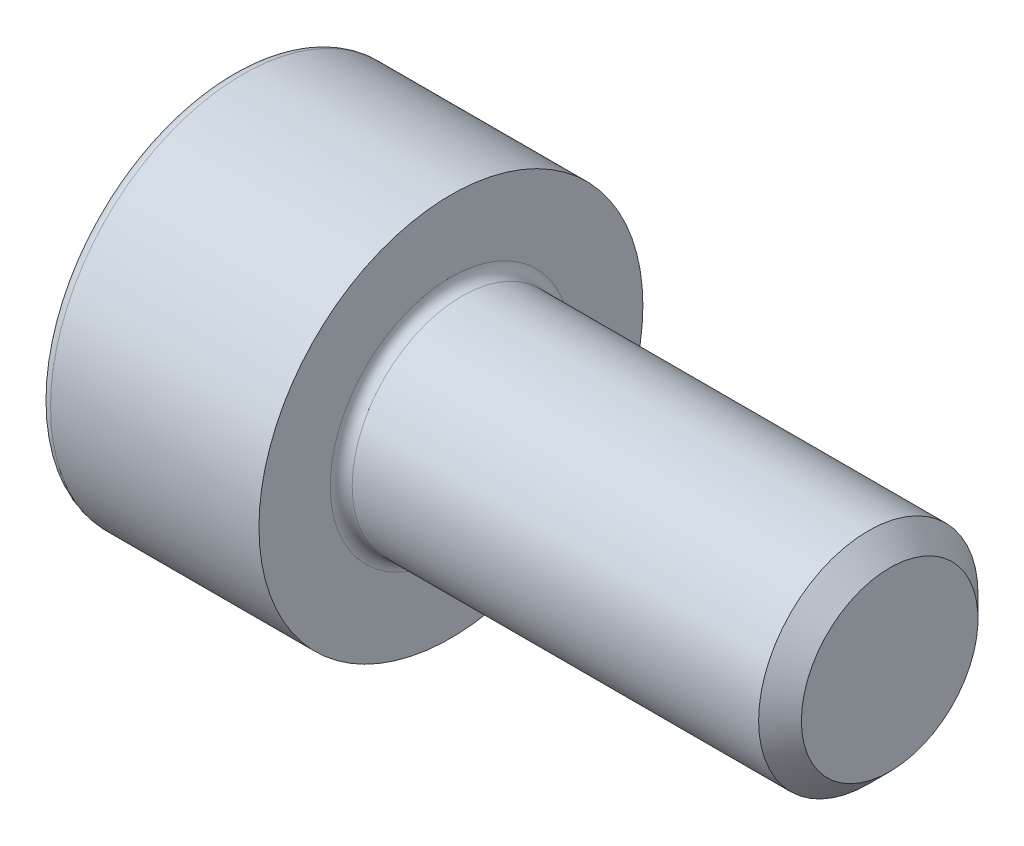
ISO-10303-21;
HEADER;
FILE_DESCRIPTION(('STEP AP214'),'2;1');
FILE_NAME('part.step','',(''),(''),'','','');
FILE_SCHEMA(('AUTOMOTIVE_DESIGN { 1 0 10303 214 1 1 1 1 }'));
ENDSEC;
DATA;
#1=APPLICATION_CONTEXT('core data for automotive mechanical design processes');
#2=APPLICATION_PROTOCOL_DEFINITION('international standard','automotive_design',2000,#1);
#3=PRODUCT_CONTEXT('',#1,'mechanical');
#4=PRODUCT('Part','Part','',(#3));
#5=PRODUCT_RELATED_PRODUCT_CATEGORY('part','',(#4));
#6=PRODUCT_DEFINITION_FORMATION('','',#4);
#7=PRODUCT_DEFINITION_CONTEXT('part definition',#1,'design');
#8=PRODUCT_DEFINITION('design','',#6,#7);
#9=PRODUCT_DEFINITION_SHAPE('','',#8);
#10=(LENGTH_UNIT() NAMED_UNIT(*) SI_UNIT(.MILLI.,.METRE.));
#11=(NAMED_UNIT(*) PLANE_ANGLE_UNIT() SI_UNIT($,.RADIAN.));
#12=(NAMED_UNIT(*) SI_UNIT($,.STERADIAN.) SOLID_ANGLE_UNIT());
#13=UNCERTAINTY_MEASURE_WITH_UNIT(LENGTH_MEASURE(1.E-05),#10,'distance_accuracy_value','');
#14=(GEOMETRIC_REPRESENTATION_CONTEXT(3) GLOBAL_UNCERTAINTY_ASSIGNED_CONTEXT((#13)) GLOBAL_UNIT_ASSIGNED_CONTEXT((#10,
#11,#12)) REPRESENTATION_CONTEXT('',''));
#15=CARTESIAN_POINT('',(0.,0.,0.));
#16=DIRECTION('',(0.,0.,1.));
#17=DIRECTION('',(1.,0.,0.));
#18=AXIS2_PLACEMENT_3D('',#15,#16,#17);
#19=CARTESIAN_POINT('',(0.,0.,0.));
#20=DIRECTION('',(-1.,0.,0.));
#21=DIRECTION('',(0.,0.,1.));
#22=AXIS2_PLACEMENT_3D('',#19,#20,#21);
#23=PLANE('',#22);
#24=DIRECTION('',(0.,-0.499999999999999,0.866025403784439));
#25=VECTOR('',#24,1.);
#26=CARTESIAN_POINT('',(0.,1.77304267668134,0.));
#27=LINE('',#26,#25);
#28=CARTESIAN_POINT('',(0.,1.77304267668134,0.));
#29=VERTEX_POINT('',#28);
#30=CARTESIAN_POINT('',(0.,0.886521338340669,1.5355));
#31=VERTEX_POINT('',#30);
#32=EDGE_CURVE('E109',#29,#31,#27,.T.);
#33=ORIENTED_EDGE('',*,*,#32,.T.);
#34=DIRECTION('',(0.,1.,0.));
#35=VECTOR('',#34,1.);
#36=CARTESIAN_POINT('',(0.,-0.886521338340671,1.5355));
#37=LINE('',#36,#35);
#38=CARTESIAN_POINT('',(0.,-0.886521338340671,1.5355));
#39=VERTEX_POINT('',#38);
#40=EDGE_CURVE('E98',#39,#31,#37,.T.);
#41=ORIENTED_EDGE('',*,*,#40,.F.);
#42=DIRECTION('',(0.,-0.500000000000001,-0.866025403784438));
#43=VECTOR('',#42,1.);
#44=CARTESIAN_POINT('',(0.,-0.886521338340671,1.5355));
#45=LINE('',#44,#43);
#46=CARTESIAN_POINT('',(0.,-1.77304267668134,0.));
#47=VERTEX_POINT('',#46);
#48=EDGE_CURVE('E108',#39,#47,#45,.T.);
#49=ORIENTED_EDGE('',*,*,#48,.T.);
#50=DIRECTION('',(0.,0.499999999999999,-0.866025403784439));
#51=VECTOR('',#50,1.);
#52=CARTESIAN_POINT('',(0.,-1.77304267668134,0.));
#53=LINE('',#52,#51);
#54=CARTESIAN_POINT('',(0.,-0.886521338340675,-1.5355));
#55=VERTEX_POINT('',#54);
#56=EDGE_CURVE('E123',#47,#55,#53,.T.);
#57=ORIENTED_EDGE('',*,*,#56,.T.);
#58=DIRECTION('',(0.,-1.,0.));
#59=VECTOR('',#58,1.);
#60=CARTESIAN_POINT('',(0.,0.886521338340665,-1.5355));
#61=LINE('',#60,#59);
#62=CARTESIAN_POINT('',(0.,0.886521338340665,-1.5355));
#63=VERTEX_POINT('',#62);
#64=EDGE_CURVE('E126',#63,#55,#61,.T.);
#65=ORIENTED_EDGE('',*,*,#64,.F.);
#66=DIRECTION('',(0.,-0.500000000000001,-0.866025403784438));
#67=VECTOR('',#66,1.);
#68=CARTESIAN_POINT('',(0.,1.77304267668134,0.));
#69=LINE('',#68,#67);
#70=EDGE_CURVE('E118',#29,#63,#69,.T.);
#71=ORIENTED_EDGE('',*,*,#70,.F.);
#72=EDGE_LOOP('',(#33,#41,#49,#57,#65,#71));
#73=FACE_BOUND('',#72,.T.);
#74=CARTESIAN_POINT('',(0.,0.,0.));
#75=DIRECTION('',(-1.,0.,0.));
#76=DIRECTION('',(0.,0.,1.));
#77=AXIS2_PLACEMENT_3D('',#74,#75,#76);
#78=CIRCLE('',#77,3.3);
#79=CARTESIAN_POINT('',(0.,0.,3.3));
#80=VERTEX_POINT('',#79);
#81=EDGE_CURVE('E33',#80,#80,#78,.T.);
#82=ORIENTED_EDGE('',*,*,#81,.T.);
#83=EDGE_LOOP('',(#82));
#84=FACE_BOUND('',#83,.T.);
#85=ADVANCED_FACE('F26',(#73,#84),#23,.T.);
#86=CARTESIAN_POINT('',(-31.75,0.,0.));
#87=DIRECTION('',(-1.,0.,0.));
#88=DIRECTION('',(0.,0.,1.));
#89=AXIS2_PLACEMENT_3D('',#86,#87,#88);
#90=CYLINDRICAL_SURFACE('',#89,3.5);
#91=CARTESIAN_POINT('',(0.199999999999999,0.,0.));
#92=DIRECTION('',(-1.,0.,0.));
#93=DIRECTION('',(0.,0.,1.));
#94=AXIS2_PLACEMENT_3D('',#91,#92,#93);
#95=CIRCLE('',#94,3.5);
#96=CARTESIAN_POINT('',(0.199999999999999,0.,3.5));
#97=VERTEX_POINT('',#96);
#98=EDGE_CURVE('E11',#97,#97,#95,.F.);
#99=ORIENTED_EDGE('',*,*,#98,.T.);
#100=EDGE_LOOP('',(#99));
#101=FACE_BOUND('',#100,.T.);
#102=CARTESIAN_POINT('',(4.,0.,0.));
#103=DIRECTION('',(-1.,0.,0.));
#104=DIRECTION('',(0.,0.,1.));
#105=AXIS2_PLACEMENT_3D('',#102,#103,#104);
#106=CIRCLE('',#105,3.5);
#107=CARTESIAN_POINT('',(4.,0.,3.5));
#108=VERTEX_POINT('',#107);
#109=EDGE_CURVE('E172',#108,#108,#106,.T.);
#110=ORIENTED_EDGE('',*,*,#109,.T.);
#111=EDGE_LOOP('',(#110));
#112=FACE_BOUND('',#111,.T.);
#113=ADVANCED_FACE('F200',(#101,#112),#90,.T.);
#114=CARTESIAN_POINT('',(4.,3.5,0.));
#115=DIRECTION('',(1.,0.,0.));
#116=DIRECTION('',(0.,0.,-1.));
#117=AXIS2_PLACEMENT_3D('',#114,#115,#116);
#118=PLANE('',#117);
#119=CARTESIAN_POINT('',(4.,0.,0.));
#120=DIRECTION('',(1.,0.,0.));
#121=DIRECTION('',(0.,0.,-1.));
#122=AXIS2_PLACEMENT_3D('',#119,#120,#121);
#123=CIRCLE('',#122,2.2);
#124=CARTESIAN_POINT('',(4.,0.,-2.2));
#125=VERTEX_POINT('',#124);
#126=EDGE_CURVE('E175',#125,#125,#123,.F.);
#127=ORIENTED_EDGE('',*,*,#126,.T.);
#128=EDGE_LOOP('',(#127));
#129=FACE_BOUND('',#128,.T.);
#130=ORIENTED_EDGE('',*,*,#109,.F.);
#131=EDGE_LOOP('',(#130));
#132=FACE_BOUND('',#131,.T.);
#133=ADVANCED_FACE('F203',(#129,#132),#118,.T.);
#134=CARTESIAN_POINT('',(-31.75,0.,0.));
#135=DIRECTION('',(-1.,0.,0.));
#136=DIRECTION('',(0.,0.,1.));
#137=AXIS2_PLACEMENT_3D('',#134,#135,#136);
#138=CYLINDRICAL_SURFACE('',#137,2.);
#139=CARTESIAN_POINT('',(4.2,0.,0.));
#140=DIRECTION('',(1.,0.,0.));
#141=DIRECTION('',(0.,0.,-1.));
#142=AXIS2_PLACEMENT_3D('',#139,#140,#141);
#143=CIRCLE('',#142,2.);
#144=CARTESIAN_POINT('',(4.2,0.,-2.));
#145=VERTEX_POINT('',#144);
#146=EDGE_CURVE('E178',#145,#145,#143,.T.);
#147=ORIENTED_EDGE('',*,*,#146,.T.);
#148=EDGE_LOOP('',(#147));
#149=FACE_BOUND('',#148,.T.);
#150=CARTESIAN_POINT('',(11.61,0.,0.));
#151=DIRECTION('',(-1.,0.,0.));
#152=DIRECTION('',(0.,0.,1.));
#153=AXIS2_PLACEMENT_3D('',#150,#151,#152);
#154=CIRCLE('',#153,2.);
#155=CARTESIAN_POINT('',(11.61,0.,2.));
#156=VERTEX_POINT('',#155);
#157=EDGE_CURVE('E169',#156,#156,#154,.T.);
#158=ORIENTED_EDGE('',*,*,#157,.T.);
#159=EDGE_LOOP('',(#158));
#160=FACE_BOUND('',#159,.T.);
#161=ADVANCED_FACE('F208',(#149,#160),#138,.T.);
#162=CARTESIAN_POINT('',(12.,0.,0.));
#163=DIRECTION('',(-1.,0.,0.));
#164=DIRECTION('',(0.,0.,1.));
#165=AXIS2_PLACEMENT_3D('',#162,#163,#164);
#166=CONICAL_SURFACE('',#165,1.61,0.785398163397482);
#167=ORIENTED_EDGE('',*,*,#157,.F.);
#168=EDGE_LOOP('',(#167));
#169=FACE_BOUND('',#168,.T.);
#170=CARTESIAN_POINT('',(12.,0.,0.));
#171=DIRECTION('',(-1.,0.,0.));
#172=DIRECTION('',(0.,0.,1.));
#173=AXIS2_PLACEMENT_3D('',#170,#171,#172);
#174=CIRCLE('',#173,1.61);
#175=CARTESIAN_POINT('',(12.,0.,1.61));
#176=VERTEX_POINT('',#175);
#177=EDGE_CURVE('E165',#176,#176,#174,.T.);
#178=ORIENTED_EDGE('',*,*,#177,.T.);
#179=EDGE_LOOP('',(#178));
#180=FACE_BOUND('',#179,.T.);
#181=ADVANCED_FACE('F215',(#169,#180),#166,.T.);
#182=CARTESIAN_POINT('',(12.,1.61,0.));
#183=DIRECTION('',(1.,0.,0.));
#184=DIRECTION('',(0.,0.,-1.));
#185=AXIS2_PLACEMENT_3D('',#182,#183,#184);
#186=PLANE('',#185);
#187=ORIENTED_EDGE('',*,*,#177,.F.);
#188=EDGE_LOOP('',(#187));
#189=FACE_BOUND('',#188,.T.);
#190=ADVANCED_FACE('F195',(#189),#186,.T.);
#191=CARTESIAN_POINT('',(4.2,0.,0.));
#192=DIRECTION('',(1.,0.,0.));
#193=DIRECTION('',(0.,0.,-1.));
#194=AXIS2_PLACEMENT_3D('',#191,#192,#193);
#195=TOROIDAL_SURFACE('',#194,2.2,0.2);
#196=ORIENTED_EDGE('',*,*,#146,.F.);
#197=EDGE_LOOP('',(#196));
#198=FACE_BOUND('',#197,.T.);
#199=ORIENTED_EDGE('',*,*,#126,.F.);
#200=EDGE_LOOP('',(#199));
#201=FACE_BOUND('',#200,.T.);
#202=ADVANCED_FACE('F185',(#198,#201),#195,.F.);
#203=CARTESIAN_POINT('',(0.199999999999999,0.,0.));
#204=DIRECTION('',(-1.,0.,0.));
#205=DIRECTION('',(0.,0.,1.));
#206=AXIS2_PLACEMENT_3D('',#203,#204,#205);
#207=TOROIDAL_SURFACE('',#206,3.3,0.2);
#208=ORIENTED_EDGE('',*,*,#98,.F.);
#209=EDGE_LOOP('',(#208));
#210=FACE_BOUND('',#209,.T.);
#211=ORIENTED_EDGE('',*,*,#81,.F.);
#212=EDGE_LOOP('',(#211));
#213=FACE_BOUND('',#212,.T.);
#214=ADVANCED_FACE('F183',(#210,#213),#207,.T.);
#215=CARTESIAN_POINT('',(2.,1.77304267668134,0.));
#216=DIRECTION('',(0.,-0.866025403784439,-0.499999999999999));
#217=DIRECTION('',(0.,0.499999999999999,-0.866025403784439));
#218=AXIS2_PLACEMENT_3D('',#215,#216,#217);
#219=PLANE('',#218);
#220=ORIENTED_EDGE('',*,*,#32,.F.);
#221=DIRECTION('',(-1.,0.,0.));
#222=VECTOR('',#221,1.);
#223=CARTESIAN_POINT('',(2.,1.77304267668134,0.));
#224=LINE('',#223,#222);
#225=CARTESIAN_POINT('',(2.,1.77304267668134,0.));
#226=VERTEX_POINT('',#225);
#227=EDGE_CURVE('E150',#226,#29,#224,.T.);
#228=ORIENTED_EDGE('',*,*,#227,.F.);
#229=DIRECTION('',(0.,-0.499999999999999,0.866025403784439));
#230=VECTOR('',#229,1.);
#231=CARTESIAN_POINT('',(2.,1.77304267668134,0.));
#232=LINE('',#231,#230);
#233=CARTESIAN_POINT('',(2.,1.32978200751101,0.767749999999998));
#234=VERTEX_POINT('',#233);
#235=EDGE_CURVE('E40',#226,#234,#232,.T.);
#236=ORIENTED_EDGE('',*,*,#235,.T.);
#237=CARTESIAN_POINT('',(2.,0.886521338340669,1.5355));
#238=VERTEX_POINT('',#237);
#239=EDGE_CURVE('E113',#234,#238,#232,.T.);
#240=ORIENTED_EDGE('',*,*,#239,.T.);
#241=DIRECTION('',(-1.,0.,0.));
#242=VECTOR('',#241,1.);
#243=CARTESIAN_POINT('',(2.,0.886521338340669,1.5355));
#244=LINE('',#243,#242);
#245=EDGE_CURVE('E102',#238,#31,#244,.T.);
#246=ORIENTED_EDGE('',*,*,#245,.T.);
#247=EDGE_LOOP('',(#220,#228,#236,#240,#246));
#248=FACE_BOUND('',#247,.T.);
#249=ADVANCED_FACE('F111',(#248),#219,.T.);
#250=CARTESIAN_POINT('',(2.,-0.886521338340671,1.5355));
#251=DIRECTION('',(0.,0.,1.));
#252=DIRECTION('',(0.,-1.,0.));
#253=AXIS2_PLACEMENT_3D('',#250,#251,#252);
#254=PLANE('',#253);
#255=ORIENTED_EDGE('',*,*,#40,.T.);
#256=ORIENTED_EDGE('',*,*,#245,.F.);
#257=DIRECTION('',(0.,1.,0.));
#258=VECTOR('',#257,1.);
#259=CARTESIAN_POINT('',(2.,-0.886521338340671,1.5355));
#260=LINE('',#259,#258);
#261=CARTESIAN_POINT('',(2.,0.,1.5355));
#262=VERTEX_POINT('',#261);
#263=EDGE_CURVE('E130',#262,#238,#260,.T.);
#264=ORIENTED_EDGE('',*,*,#263,.F.);
#265=CARTESIAN_POINT('',(2.,-0.886521338340671,1.5355));
#266=VERTEX_POINT('',#265);
#267=EDGE_CURVE('E131',#266,#262,#260,.T.);
#268=ORIENTED_EDGE('',*,*,#267,.F.);
#269=DIRECTION('',(-1.,0.,0.));
#270=VECTOR('',#269,1.);
#271=CARTESIAN_POINT('',(2.,-0.886521338340671,1.5355));
#272=LINE('',#271,#270);
#273=EDGE_CURVE('E104',#266,#39,#272,.T.);
#274=ORIENTED_EDGE('',*,*,#273,.T.);
#275=EDGE_LOOP('',(#255,#256,#264,#268,#274));
#276=FACE_BOUND('',#275,.T.);
#277=ADVANCED_FACE('F100',(#276),#254,.F.);
#278=CARTESIAN_POINT('',(2.,-0.886521338340671,1.5355));
#279=DIRECTION('',(0.,0.866025403784438,-0.500000000000001));
#280=DIRECTION('',(0.,0.500000000000001,0.866025403784438));
#281=AXIS2_PLACEMENT_3D('',#278,#279,#280);
#282=PLANE('',#281);
#283=ORIENTED_EDGE('',*,*,#48,.F.);
#284=ORIENTED_EDGE('',*,*,#273,.F.);
#285=DIRECTION('',(0.,-0.500000000000001,-0.866025403784438));
#286=VECTOR('',#285,1.);
#287=CARTESIAN_POINT('',(2.,-0.886521338340671,1.5355));
#288=LINE('',#287,#286);
#289=CARTESIAN_POINT('',(2.,-1.329782007511,0.767750000000002));
#290=VERTEX_POINT('',#289);
#291=EDGE_CURVE('E135',#266,#290,#288,.T.);
#292=ORIENTED_EDGE('',*,*,#291,.T.);
#293=CARTESIAN_POINT('',(2.,-1.77304267668134,0.));
#294=VERTEX_POINT('',#293);
#295=EDGE_CURVE('E134',#290,#294,#288,.T.);
#296=ORIENTED_EDGE('',*,*,#295,.T.);
#297=DIRECTION('',(-1.,0.,0.));
#298=VECTOR('',#297,1.);
#299=CARTESIAN_POINT('',(2.,-1.77304267668134,0.));
#300=LINE('',#299,#298);
#301=EDGE_CURVE('E158',#294,#47,#300,.T.);
#302=ORIENTED_EDGE('',*,*,#301,.T.);
#303=EDGE_LOOP('',(#283,#284,#292,#296,#302));
#304=FACE_BOUND('',#303,.T.);
#305=ADVANCED_FACE('F263',(#304),#282,.T.);
#306=CARTESIAN_POINT('',(2.,-1.77304267668134,0.));
#307=DIRECTION('',(0.,0.866025403784439,0.499999999999999));
#308=DIRECTION('',(0.,-0.499999999999999,0.866025403784439));
#309=AXIS2_PLACEMENT_3D('',#306,#307,#308);
#310=PLANE('',#309);
#311=ORIENTED_EDGE('',*,*,#56,.F.);
#312=ORIENTED_EDGE('',*,*,#301,.F.);
#313=DIRECTION('',(0.,0.499999999999999,-0.866025403784439));
#314=VECTOR('',#313,1.);
#315=CARTESIAN_POINT('',(2.,-1.77304267668134,0.));
#316=LINE('',#315,#314);
#317=CARTESIAN_POINT('',(2.,-1.32978200751101,-0.76775));
#318=VERTEX_POINT('',#317);
#319=EDGE_CURVE('E139',#294,#318,#316,.T.);
#320=ORIENTED_EDGE('',*,*,#319,.T.);
#321=CARTESIAN_POINT('',(2.,-0.886521338340675,-1.5355));
#322=VERTEX_POINT('',#321);
#323=EDGE_CURVE('E138',#318,#322,#316,.T.);
#324=ORIENTED_EDGE('',*,*,#323,.T.);
#325=DIRECTION('',(-1.,0.,0.));
#326=VECTOR('',#325,1.);
#327=CARTESIAN_POINT('',(2.,-0.886521338340675,-1.5355));
#328=LINE('',#327,#326);
#329=EDGE_CURVE('E155',#322,#55,#328,.T.);
#330=ORIENTED_EDGE('',*,*,#329,.T.);
#331=EDGE_LOOP('',(#311,#312,#320,#324,#330));
#332=FACE_BOUND('',#331,.T.);
#333=ADVANCED_FACE('F270',(#332),#310,.T.);
#334=CARTESIAN_POINT('',(2.,0.886521338340665,-1.5355));
#335=DIRECTION('',(0.,0.,-1.));
#336=DIRECTION('',(0.,1.,0.));
#337=AXIS2_PLACEMENT_3D('',#334,#335,#336);
#338=PLANE('',#337);
#339=ORIENTED_EDGE('',*,*,#64,.T.);
#340=ORIENTED_EDGE('',*,*,#329,.F.);
#341=DIRECTION('',(0.,-1.,0.));
#342=VECTOR('',#341,1.);
#343=CARTESIAN_POINT('',(2.,0.886521338340665,-1.5355));
#344=LINE('',#343,#342);
#345=CARTESIAN_POINT('',(2.,0.,-1.5355));
#346=VERTEX_POINT('',#345);
#347=EDGE_CURVE('E142',#346,#322,#344,.T.);
#348=ORIENTED_EDGE('',*,*,#347,.F.);
#349=CARTESIAN_POINT('',(2.,0.886521338340665,-1.5355));
#350=VERTEX_POINT('',#349);
#351=EDGE_CURVE('E143',#350,#346,#344,.T.);
#352=ORIENTED_EDGE('',*,*,#351,.F.);
#353=DIRECTION('',(-1.,0.,0.));
#354=VECTOR('',#353,1.);
#355=CARTESIAN_POINT('',(2.,0.886521338340665,-1.5355));
#356=LINE('',#355,#354);
#357=EDGE_CURVE('E152',#350,#63,#356,.T.);
#358=ORIENTED_EDGE('',*,*,#357,.T.);
#359=EDGE_LOOP('',(#339,#340,#348,#352,#358));
#360=FACE_BOUND('',#359,.T.);
#361=ADVANCED_FACE('F278',(#360),#338,.F.);
#362=CARTESIAN_POINT('',(2.,1.77304267668134,0.));
#363=DIRECTION('',(0.,0.866025403784438,-0.500000000000001));
#364=DIRECTION('',(0.,0.500000000000001,0.866025403784438));
#365=AXIS2_PLACEMENT_3D('',#362,#363,#364);
#366=PLANE('',#365);
#367=ORIENTED_EDGE('',*,*,#70,.T.);
#368=ORIENTED_EDGE('',*,*,#357,.F.);
#369=DIRECTION('',(0.,-0.500000000000001,-0.866025403784438));
#370=VECTOR('',#369,1.);
#371=CARTESIAN_POINT('',(2.,1.77304267668134,0.));
#372=LINE('',#371,#370);
#373=CARTESIAN_POINT('',(2.,1.329782007511,-0.767750000000001));
#374=VERTEX_POINT('',#373);
#375=EDGE_CURVE('E146',#374,#350,#372,.T.);
#376=ORIENTED_EDGE('',*,*,#375,.F.);
#377=EDGE_CURVE('E147',#226,#374,#372,.T.);
#378=ORIENTED_EDGE('',*,*,#377,.F.);
#379=ORIENTED_EDGE('',*,*,#227,.T.);
#380=EDGE_LOOP('',(#367,#368,#376,#378,#379));
#381=FACE_BOUND('',#380,.T.);
#382=ADVANCED_FACE('F286',(#381),#366,.F.);
#383=CARTESIAN_POINT('',(2.,0.88652133834067,1.5355));
#384=DIRECTION('',(-1.,0.,0.));
#385=DIRECTION('',(0.,0.,1.));
#386=AXIS2_PLACEMENT_3D('',#383,#384,#385);
#387=PLANE('',#386);
#388=CARTESIAN_POINT('',(2.,0.,0.));
#389=DIRECTION('',(-1.,0.,0.));
#390=DIRECTION('',(0.,0.,1.));
#391=AXIS2_PLACEMENT_3D('',#388,#389,#390);
#392=CIRCLE('',#391,1.5355);
#393=EDGE_CURVE('E114',#290,#262,#392,.T.);
#394=ORIENTED_EDGE('',*,*,#393,.F.);
#395=ORIENTED_EDGE('',*,*,#291,.F.);
#396=ORIENTED_EDGE('',*,*,#267,.T.);
#397=EDGE_LOOP('',(#394,#395,#396));
#398=FACE_BOUND('',#397,.T.);
#399=ADVANCED_FACE('F294',(#398),#387,.T.);
#400=EDGE_CURVE('E345',#318,#290,#392,.T.);
#401=ORIENTED_EDGE('',*,*,#400,.F.);
#402=ORIENTED_EDGE('',*,*,#319,.F.);
#403=ORIENTED_EDGE('',*,*,#295,.F.);
#404=EDGE_LOOP('',(#401,#402,#403));
#405=FACE_BOUND('',#404,.T.);
#406=ADVANCED_FACE('F302',(#405),#387,.T.);
#407=EDGE_CURVE('E346',#346,#318,#392,.T.);
#408=ORIENTED_EDGE('',*,*,#407,.F.);
#409=ORIENTED_EDGE('',*,*,#347,.T.);
#410=ORIENTED_EDGE('',*,*,#323,.F.);
#411=EDGE_LOOP('',(#408,#409,#410));
#412=FACE_BOUND('',#411,.T.);
#413=ADVANCED_FACE('F310',(#412),#387,.T.);
#414=EDGE_CURVE('E347',#374,#346,#392,.T.);
#415=ORIENTED_EDGE('',*,*,#414,.F.);
#416=ORIENTED_EDGE('',*,*,#375,.T.);
#417=ORIENTED_EDGE('',*,*,#351,.T.);
#418=EDGE_LOOP('',(#415,#416,#417));
#419=FACE_BOUND('',#418,.T.);
#420=ADVANCED_FACE('F317',(#419),#387,.T.);
#421=EDGE_CURVE('E166',#234,#374,#392,.T.);
#422=ORIENTED_EDGE('',*,*,#421,.F.);
#423=ORIENTED_EDGE('',*,*,#235,.F.);
#424=ORIENTED_EDGE('',*,*,#377,.T.);
#425=EDGE_LOOP('',(#422,#423,#424));
#426=FACE_BOUND('',#425,.T.);
#427=ADVANCED_FACE('F324',(#426),#387,.T.);
#428=EDGE_CURVE('E162',#262,#234,#392,.T.);
#429=ORIENTED_EDGE('',*,*,#428,.F.);
#430=ORIENTED_EDGE('',*,*,#263,.T.);
#431=ORIENTED_EDGE('',*,*,#239,.F.);
#432=EDGE_LOOP('',(#429,#430,#431));
#433=FACE_BOUND('',#432,.T.);
#434=ADVANCED_FACE('F249',(#433),#387,.T.);
#435=CARTESIAN_POINT('',(2.,0.,0.));
#436=DIRECTION('',(-1.,0.,0.));
#437=DIRECTION('',(0.,0.,1.));
#438=AXIS2_PLACEMENT_3D('',#435,#436,#437);
#439=CONICAL_SURFACE('',#438,1.5355,1.04719755119659);
#440=CARTESIAN_POINT('',(2.88652133834068,0.,0.));
#441=VERTEX_POINT('',#440);
#442=VERTEX_LOOP('',#441);
#443=FACE_BOUND('',#442,.T.);
#444=ORIENTED_EDGE('',*,*,#428,.T.);
#445=ORIENTED_EDGE('',*,*,#421,.T.);
#446=ORIENTED_EDGE('',*,*,#414,.T.);
#447=ORIENTED_EDGE('',*,*,#407,.T.);
#448=ORIENTED_EDGE('',*,*,#400,.T.);
#449=ORIENTED_EDGE('',*,*,#393,.T.);
#450=EDGE_LOOP('',(#444,#445,#446,#447,#448,#449));
#451=FACE_BOUND('',#450,.T.);
#452=ADVANCED_FACE('F245',(#443,#451),#439,.F.);
#453=CLOSED_SHELL('',(#85,#113,#133,#161,#181,#190,#202,#214,#249,#277,#305,#333,#361,#382,#399,
#406,#413,#420,#427,#434,#452));
#454=MANIFOLD_SOLID_BREP('B2',#453);
#455=ADVANCED_BREP_SHAPE_REPRESENTATION('',(#18,#454),#14);
#456=SHAPE_DEFINITION_REPRESENTATION(#9,#455);
ENDSEC;
END-ISO-10303-21;
